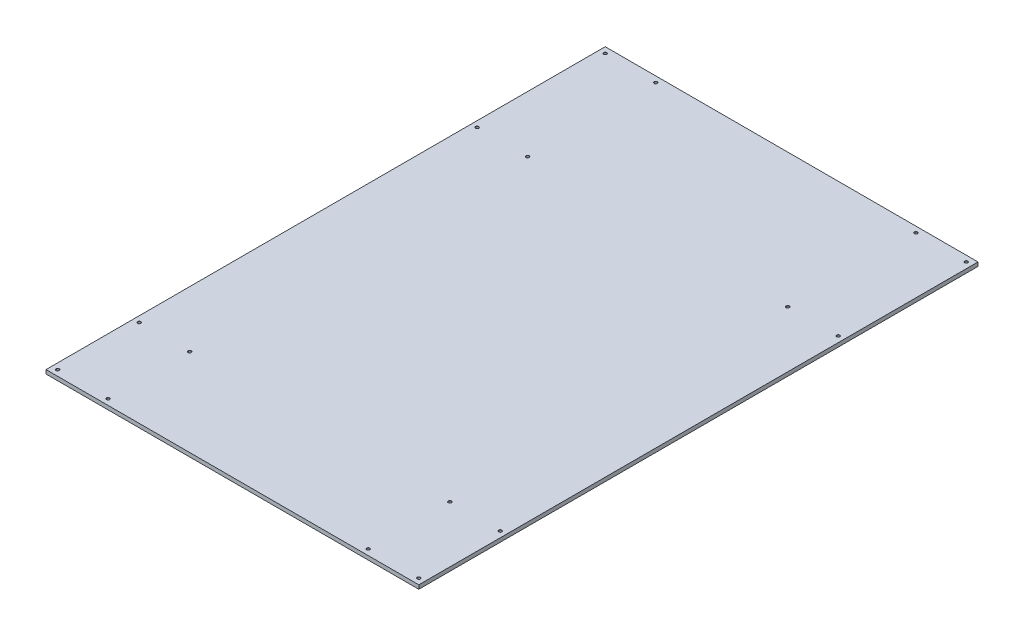
ISO-10303-21;
HEADER;
FILE_DESCRIPTION(('STEP AP214'),'2;1');
FILE_NAME('part.step','',(''),(''),'','','');
FILE_SCHEMA(('AUTOMOTIVE_DESIGN { 1 0 10303 214 1 1 1 1 }'));
ENDSEC;
DATA;
#1=APPLICATION_CONTEXT('core data for automotive mechanical design processes');
#2=APPLICATION_PROTOCOL_DEFINITION('international standard','automotive_design',2000,#1);
#3=PRODUCT_CONTEXT('',#1,'mechanical');
#4=PRODUCT('Part','Part','',(#3));
#5=PRODUCT_RELATED_PRODUCT_CATEGORY('part','',(#4));
#6=PRODUCT_DEFINITION_FORMATION('','',#4);
#7=PRODUCT_DEFINITION_CONTEXT('part definition',#1,'design');
#8=PRODUCT_DEFINITION('design','',#6,#7);
#9=PRODUCT_DEFINITION_SHAPE('','',#8);
#10=(LENGTH_UNIT() NAMED_UNIT(*) SI_UNIT(.MILLI.,.METRE.));
#11=(NAMED_UNIT(*) PLANE_ANGLE_UNIT() SI_UNIT($,.RADIAN.));
#12=(NAMED_UNIT(*) SI_UNIT($,.STERADIAN.) SOLID_ANGLE_UNIT());
#13=UNCERTAINTY_MEASURE_WITH_UNIT(LENGTH_MEASURE(1.E-05),#10,'distance_accuracy_value','');
#14=(GEOMETRIC_REPRESENTATION_CONTEXT(3) GLOBAL_UNCERTAINTY_ASSIGNED_CONTEXT((#13)) GLOBAL_UNIT_ASSIGNED_CONTEXT((#10,
#11,#12)) REPRESENTATION_CONTEXT('',''));
#15=CARTESIAN_POINT('',(0.,0.,0.));
#16=DIRECTION('',(0.,0.,1.));
#17=DIRECTION('',(1.,0.,0.));
#18=AXIS2_PLACEMENT_3D('',#15,#16,#17);
#19=CARTESIAN_POINT('',(609.6,-12.7,914.4));
#20=DIRECTION('',(1.,0.,0.));
#21=DIRECTION('',(0.,0.,-1.));
#22=AXIS2_PLACEMENT_3D('',#19,#20,#21);
#23=PLANE('',#22);
#24=DIRECTION('',(0.,0.,-1.));
#25=VECTOR('',#24,1.);
#26=CARTESIAN_POINT('',(609.6,0.,914.4));
#27=LINE('',#26,#25);
#28=CARTESIAN_POINT('',(609.6,0.,914.4));
#29=VERTEX_POINT('',#28);
#30=CARTESIAN_POINT('',(609.6,0.,-914.4));
#31=VERTEX_POINT('',#30);
#32=EDGE_CURVE('E285',#29,#31,#27,.T.);
#33=ORIENTED_EDGE('',*,*,#32,.F.);
#34=DIRECTION('',(0.,1.,0.));
#35=VECTOR('',#34,1.);
#36=CARTESIAN_POINT('',(609.6,-12.7,914.4));
#37=LINE('',#36,#35);
#38=CARTESIAN_POINT('',(609.6,-12.7,914.4));
#39=VERTEX_POINT('',#38);
#40=EDGE_CURVE('E11',#39,#29,#37,.T.);
#41=ORIENTED_EDGE('',*,*,#40,.F.);
#42=DIRECTION('',(0.,0.,-1.));
#43=VECTOR('',#42,1.);
#44=CARTESIAN_POINT('',(609.6,-12.7,914.4));
#45=LINE('',#44,#43);
#46=CARTESIAN_POINT('',(609.6,-12.7,-914.4));
#47=VERTEX_POINT('',#46);
#48=EDGE_CURVE('E286',#39,#47,#45,.T.);
#49=ORIENTED_EDGE('',*,*,#48,.T.);
#50=DIRECTION('',(0.,1.,0.));
#51=VECTOR('',#50,1.);
#52=CARTESIAN_POINT('',(609.6,-12.7,-914.4));
#53=LINE('',#52,#51);
#54=EDGE_CURVE('E42',#47,#31,#53,.T.);
#55=ORIENTED_EDGE('',*,*,#54,.T.);
#56=EDGE_LOOP('',(#33,#41,#49,#55));
#57=FACE_BOUND('',#56,.T.);
#58=ADVANCED_FACE('F39',(#57),#23,.T.);
#59=CARTESIAN_POINT('',(-609.6,-12.7,914.4));
#60=DIRECTION('',(0.,0.,1.));
#61=DIRECTION('',(1.,0.,0.));
#62=AXIS2_PLACEMENT_3D('',#59,#60,#61);
#63=PLANE('',#62);
#64=DIRECTION('',(1.,0.,0.));
#65=VECTOR('',#64,1.);
#66=CARTESIAN_POINT('',(-609.6,0.,914.4));
#67=LINE('',#66,#65);
#68=CARTESIAN_POINT('',(-609.6,0.,914.4));
#69=VERTEX_POINT('',#68);
#70=EDGE_CURVE('E289',#69,#29,#67,.T.);
#71=ORIENTED_EDGE('',*,*,#70,.F.);
#72=DIRECTION('',(0.,1.,0.));
#73=VECTOR('',#72,1.);
#74=CARTESIAN_POINT('',(-609.6,-12.7,914.4));
#75=LINE('',#74,#73);
#76=CARTESIAN_POINT('',(-609.6,-12.7,914.4));
#77=VERTEX_POINT('',#76);
#78=EDGE_CURVE('E48',#77,#69,#75,.T.);
#79=ORIENTED_EDGE('',*,*,#78,.F.);
#80=DIRECTION('',(1.,0.,0.));
#81=VECTOR('',#80,1.);
#82=CARTESIAN_POINT('',(-609.6,-12.7,914.4));
#83=LINE('',#82,#81);
#84=EDGE_CURVE('E293',#77,#39,#83,.T.);
#85=ORIENTED_EDGE('',*,*,#84,.T.);
#86=ORIENTED_EDGE('',*,*,#40,.T.);
#87=EDGE_LOOP('',(#71,#79,#85,#86));
#88=FACE_BOUND('',#87,.T.);
#89=ADVANCED_FACE('F308',(#88),#63,.T.);
#90=CARTESIAN_POINT('',(-609.6,-12.7,914.4));
#91=DIRECTION('',(-1.,0.,0.));
#92=DIRECTION('',(0.,0.,1.));
#93=AXIS2_PLACEMENT_3D('',#90,#91,#92);
#94=PLANE('',#93);
#95=DIRECTION('',(0.,0.,1.));
#96=VECTOR('',#95,1.);
#97=CARTESIAN_POINT('',(-609.6,0.,914.4));
#98=LINE('',#97,#96);
#99=CARTESIAN_POINT('',(-609.6,0.,-914.4));
#100=VERTEX_POINT('',#99);
#101=EDGE_CURVE('E300',#100,#69,#98,.T.);
#102=ORIENTED_EDGE('',*,*,#101,.F.);
#103=DIRECTION('',(0.,1.,0.));
#104=VECTOR('',#103,1.);
#105=CARTESIAN_POINT('',(-609.6,-12.7,-914.4));
#106=LINE('',#105,#104);
#107=CARTESIAN_POINT('',(-609.6,-12.7,-914.4));
#108=VERTEX_POINT('',#107);
#109=EDGE_CURVE('E304',#108,#100,#106,.T.);
#110=ORIENTED_EDGE('',*,*,#109,.F.);
#111=DIRECTION('',(0.,0.,1.));
#112=VECTOR('',#111,1.);
#113=CARTESIAN_POINT('',(-609.6,-12.7,914.4));
#114=LINE('',#113,#112);
#115=EDGE_CURVE('E291',#108,#77,#114,.T.);
#116=ORIENTED_EDGE('',*,*,#115,.T.);
#117=ORIENTED_EDGE('',*,*,#78,.T.);
#118=EDGE_LOOP('',(#102,#110,#116,#117));
#119=FACE_BOUND('',#118,.T.);
#120=ADVANCED_FACE('F311',(#119),#94,.T.);
#121=CARTESIAN_POINT('',(-609.6,-12.7,-914.4));
#122=DIRECTION('',(0.,0.,-1.));
#123=DIRECTION('',(-1.,0.,0.));
#124=AXIS2_PLACEMENT_3D('',#121,#122,#123);
#125=PLANE('',#124);
#126=DIRECTION('',(-1.,0.,0.));
#127=VECTOR('',#126,1.);
#128=CARTESIAN_POINT('',(-609.6,0.,-914.4));
#129=LINE('',#128,#127);
#130=EDGE_CURVE('E297',#31,#100,#129,.T.);
#131=ORIENTED_EDGE('',*,*,#130,.F.);
#132=ORIENTED_EDGE('',*,*,#54,.F.);
#133=DIRECTION('',(-1.,0.,0.));
#134=VECTOR('',#133,1.);
#135=CARTESIAN_POINT('',(-609.6,-12.7,-914.4));
#136=LINE('',#135,#134);
#137=EDGE_CURVE('E288',#47,#108,#136,.T.);
#138=ORIENTED_EDGE('',*,*,#137,.T.);
#139=ORIENTED_EDGE('',*,*,#109,.T.);
#140=EDGE_LOOP('',(#131,#132,#138,#139));
#141=FACE_BOUND('',#140,.T.);
#142=ADVANCED_FACE('F305',(#141),#125,.T.);
#143=CARTESIAN_POINT('',(0.,-12.7,0.));
#144=DIRECTION('',(0.,-1.,0.));
#145=DIRECTION('',(0.,0.,-1.));
#146=AXIS2_PLACEMENT_3D('',#143,#144,#145);
#147=PLANE('',#146);
#148=ORIENTED_EDGE('',*,*,#48,.F.);
#149=ORIENTED_EDGE('',*,*,#84,.F.);
#150=ORIENTED_EDGE('',*,*,#115,.F.);
#151=ORIENTED_EDGE('',*,*,#137,.F.);
#152=EDGE_LOOP('',(#148,#149,#150,#151));
#153=FACE_BOUND('',#152,.T.);
#154=ADVANCED_FACE('F313',(#153),#147,.T.);
#155=CARTESIAN_POINT('',(0.,0.,0.));
#156=DIRECTION('',(0.,-1.,0.));
#157=DIRECTION('',(0.,0.,-1.));
#158=AXIS2_PLACEMENT_3D('',#155,#156,#157);
#159=PLANE('',#158);
#160=CARTESIAN_POINT('',(590.55,0.,-895.35));
#161=DIRECTION('',(0.,1.,0.));
#162=DIRECTION('',(0.,0.,1.));
#163=AXIS2_PLACEMENT_3D('',#160,#161,#162);
#164=CIRCLE('',#163,5.19912600000005);
#165=CARTESIAN_POINT('',(590.55,0.,-890.150874));
#166=VERTEX_POINT('',#165);
#167=EDGE_CURVE('E150',#166,#166,#164,.T.);
#168=ORIENTED_EDGE('',*,*,#167,.F.);
#169=EDGE_LOOP('',(#168));
#170=FACE_BOUND('',#169,.T.);
#171=CARTESIAN_POINT('',(425.45,0.,-895.35));
#172=DIRECTION('',(0.,1.,0.));
#173=DIRECTION('',(0.,0.,1.));
#174=AXIS2_PLACEMENT_3D('',#171,#172,#173);
#175=CIRCLE('',#174,5.199126);
#176=CARTESIAN_POINT('',(425.45,0.,-890.150874));
#177=VERTEX_POINT('',#176);
#178=EDGE_CURVE('E143',#177,#177,#175,.T.);
#179=ORIENTED_EDGE('',*,*,#178,.F.);
#180=EDGE_LOOP('',(#179));
#181=FACE_BOUND('',#180,.T.);
#182=CARTESIAN_POINT('',(425.45,0.,-476.25));
#183=DIRECTION('',(0.,1.,0.));
#184=DIRECTION('',(0.,0.,1.));
#185=AXIS2_PLACEMENT_3D('',#182,#183,#184);
#186=CIRCLE('',#185,5.199126);
#187=CARTESIAN_POINT('',(425.45,0.,-471.050874));
#188=VERTEX_POINT('',#187);
#189=EDGE_CURVE('E159',#188,#188,#186,.T.);
#190=ORIENTED_EDGE('',*,*,#189,.F.);
#191=EDGE_LOOP('',(#190));
#192=FACE_BOUND('',#191,.T.);
#193=CARTESIAN_POINT('',(590.55,0.,-476.25));
#194=DIRECTION('',(0.,1.,0.));
#195=DIRECTION('',(0.,0.,1.));
#196=AXIS2_PLACEMENT_3D('',#193,#194,#195);
#197=CIRCLE('',#196,5.19912600000005);
#198=CARTESIAN_POINT('',(590.55,0.,-471.050874));
#199=VERTEX_POINT('',#198);
#200=EDGE_CURVE('E168',#199,#199,#197,.T.);
#201=ORIENTED_EDGE('',*,*,#200,.F.);
#202=EDGE_LOOP('',(#201));
#203=FACE_BOUND('',#202,.T.);
#204=CARTESIAN_POINT('',(590.55,0.,628.65));
#205=DIRECTION('',(0.,1.,0.));
#206=DIRECTION('',(0.,0.,1.));
#207=AXIS2_PLACEMENT_3D('',#204,#205,#206);
#208=CIRCLE('',#207,5.19912600000005);
#209=CARTESIAN_POINT('',(590.55,0.,633.849126));
#210=VERTEX_POINT('',#209);
#211=EDGE_CURVE('E177',#210,#210,#208,.T.);
#212=ORIENTED_EDGE('',*,*,#211,.F.);
#213=EDGE_LOOP('',(#212));
#214=FACE_BOUND('',#213,.T.);
#215=CARTESIAN_POINT('',(425.45,0.,628.65));
#216=DIRECTION('',(0.,1.,0.));
#217=DIRECTION('',(0.,0.,1.));
#218=AXIS2_PLACEMENT_3D('',#215,#216,#217);
#219=CIRCLE('',#218,5.199126);
#220=CARTESIAN_POINT('',(425.45,0.,633.849126));
#221=VERTEX_POINT('',#220);
#222=EDGE_CURVE('E186',#221,#221,#219,.T.);
#223=ORIENTED_EDGE('',*,*,#222,.F.);
#224=EDGE_LOOP('',(#223));
#225=FACE_BOUND('',#224,.T.);
#226=CARTESIAN_POINT('',(425.45,0.,895.35));
#227=DIRECTION('',(0.,1.,0.));
#228=DIRECTION('',(0.,0.,1.));
#229=AXIS2_PLACEMENT_3D('',#226,#227,#228);
#230=CIRCLE('',#229,5.199126);
#231=CARTESIAN_POINT('',(425.45,0.,900.549126));
#232=VERTEX_POINT('',#231);
#233=EDGE_CURVE('E195',#232,#232,#230,.T.);
#234=ORIENTED_EDGE('',*,*,#233,.F.);
#235=EDGE_LOOP('',(#234));
#236=FACE_BOUND('',#235,.T.);
#237=CARTESIAN_POINT('',(590.55,0.,895.35));
#238=DIRECTION('',(0.,1.,0.));
#239=DIRECTION('',(0.,0.,1.));
#240=AXIS2_PLACEMENT_3D('',#237,#238,#239);
#241=CIRCLE('',#240,5.19912600000005);
#242=CARTESIAN_POINT('',(590.55,0.,900.549126));
#243=VERTEX_POINT('',#242);
#244=EDGE_CURVE('E204',#243,#243,#241,.T.);
#245=ORIENTED_EDGE('',*,*,#244,.F.);
#246=EDGE_LOOP('',(#245));
#247=FACE_BOUND('',#246,.T.);
#248=CARTESIAN_POINT('',(-590.55,0.,-895.35));
#249=DIRECTION('',(0.,1.,0.));
#250=DIRECTION('',(0.,0.,1.));
#251=AXIS2_PLACEMENT_3D('',#248,#249,#250);
#252=CIRCLE('',#251,5.19912600000005);
#253=CARTESIAN_POINT('',(-590.55,0.,-890.150874));
#254=VERTEX_POINT('',#253);
#255=EDGE_CURVE('E213',#254,#254,#252,.T.);
#256=ORIENTED_EDGE('',*,*,#255,.F.);
#257=EDGE_LOOP('',(#256));
#258=FACE_BOUND('',#257,.T.);
#259=CARTESIAN_POINT('',(-425.45,0.,-895.35));
#260=DIRECTION('',(0.,1.,0.));
#261=DIRECTION('',(0.,0.,1.));
#262=AXIS2_PLACEMENT_3D('',#259,#260,#261);
#263=CIRCLE('',#262,5.199126);
#264=CARTESIAN_POINT('',(-425.45,0.,-890.150874));
#265=VERTEX_POINT('',#264);
#266=EDGE_CURVE('E222',#265,#265,#263,.T.);
#267=ORIENTED_EDGE('',*,*,#266,.F.);
#268=EDGE_LOOP('',(#267));
#269=FACE_BOUND('',#268,.T.);
#270=CARTESIAN_POINT('',(-425.45,0.,-476.25));
#271=DIRECTION('',(0.,1.,0.));
#272=DIRECTION('',(0.,0.,1.));
#273=AXIS2_PLACEMENT_3D('',#270,#271,#272);
#274=CIRCLE('',#273,5.199126);
#275=CARTESIAN_POINT('',(-425.45,0.,-471.050874));
#276=VERTEX_POINT('',#275);
#277=EDGE_CURVE('E231',#276,#276,#274,.T.);
#278=ORIENTED_EDGE('',*,*,#277,.F.);
#279=EDGE_LOOP('',(#278));
#280=FACE_BOUND('',#279,.T.);
#281=CARTESIAN_POINT('',(-590.55,0.,-476.25));
#282=DIRECTION('',(0.,1.,0.));
#283=DIRECTION('',(0.,0.,1.));
#284=AXIS2_PLACEMENT_3D('',#281,#282,#283);
#285=CIRCLE('',#284,5.19912600000005);
#286=CARTESIAN_POINT('',(-590.55,0.,-471.050874));
#287=VERTEX_POINT('',#286);
#288=EDGE_CURVE('E240',#287,#287,#285,.T.);
#289=ORIENTED_EDGE('',*,*,#288,.F.);
#290=EDGE_LOOP('',(#289));
#291=FACE_BOUND('',#290,.T.);
#292=CARTESIAN_POINT('',(-590.55,0.,628.65));
#293=DIRECTION('',(0.,1.,0.));
#294=DIRECTION('',(0.,0.,1.));
#295=AXIS2_PLACEMENT_3D('',#292,#293,#294);
#296=CIRCLE('',#295,5.19912600000005);
#297=CARTESIAN_POINT('',(-590.55,0.,633.849126));
#298=VERTEX_POINT('',#297);
#299=EDGE_CURVE('E249',#298,#298,#296,.T.);
#300=ORIENTED_EDGE('',*,*,#299,.F.);
#301=EDGE_LOOP('',(#300));
#302=FACE_BOUND('',#301,.T.);
#303=CARTESIAN_POINT('',(-425.45,0.,628.65));
#304=DIRECTION('',(0.,1.,0.));
#305=DIRECTION('',(0.,0.,1.));
#306=AXIS2_PLACEMENT_3D('',#303,#304,#305);
#307=CIRCLE('',#306,5.199126);
#308=CARTESIAN_POINT('',(-425.45,0.,633.849126));
#309=VERTEX_POINT('',#308);
#310=EDGE_CURVE('E258',#309,#309,#307,.T.);
#311=ORIENTED_EDGE('',*,*,#310,.F.);
#312=EDGE_LOOP('',(#311));
#313=FACE_BOUND('',#312,.T.);
#314=CARTESIAN_POINT('',(-425.45,0.,895.35));
#315=DIRECTION('',(0.,1.,0.));
#316=DIRECTION('',(0.,0.,1.));
#317=AXIS2_PLACEMENT_3D('',#314,#315,#316);
#318=CIRCLE('',#317,5.199126);
#319=CARTESIAN_POINT('',(-425.45,0.,900.549126));
#320=VERTEX_POINT('',#319);
#321=EDGE_CURVE('E267',#320,#320,#318,.T.);
#322=ORIENTED_EDGE('',*,*,#321,.F.);
#323=EDGE_LOOP('',(#322));
#324=FACE_BOUND('',#323,.T.);
#325=CARTESIAN_POINT('',(-590.55,0.,895.35));
#326=DIRECTION('',(0.,1.,0.));
#327=DIRECTION('',(0.,0.,1.));
#328=AXIS2_PLACEMENT_3D('',#325,#326,#327);
#329=CIRCLE('',#328,5.19912600000005);
#330=CARTESIAN_POINT('',(-590.55,0.,900.549126));
#331=VERTEX_POINT('',#330);
#332=EDGE_CURVE('E276',#331,#331,#329,.T.);
#333=ORIENTED_EDGE('',*,*,#332,.F.);
#334=EDGE_LOOP('',(#333));
#335=FACE_BOUND('',#334,.T.);
#336=ORIENTED_EDGE('',*,*,#32,.T.);
#337=ORIENTED_EDGE('',*,*,#130,.T.);
#338=ORIENTED_EDGE('',*,*,#101,.T.);
#339=ORIENTED_EDGE('',*,*,#70,.T.);
#340=EDGE_LOOP('',(#336,#337,#338,#339));
#341=FACE_BOUND('',#340,.T.);
#342=ADVANCED_FACE('F307',(#170,#181,#192,#203,#214,#225,#236,#247,#258,#269,#280,#291,#302,
#313,#324,#335,#341),#159,.F.);
#343=CARTESIAN_POINT('',(-590.55,-7.17947142632021,895.35));
#344=DIRECTION('',(0.,1.,0.));
#345=DIRECTION('',(0.,0.,1.));
#346=AXIS2_PLACEMENT_3D('',#343,#344,#345);
#347=CONICAL_SURFACE('',#346,4.564126,1.02974425867665);
#348=CARTESIAN_POINT('',(-590.55,-9.921875,895.35));
#349=VERTEX_POINT('',#348);
#350=VERTEX_LOOP('',#349);
#351=FACE_BOUND('',#350,.T.);
#352=CARTESIAN_POINT('',(-590.55,-7.17947142632021,895.35));
#353=DIRECTION('',(0.,1.,0.));
#354=DIRECTION('',(0.,0.,1.));
#355=AXIS2_PLACEMENT_3D('',#352,#353,#354);
#356=CIRCLE('',#355,4.564126);
#357=CARTESIAN_POINT('',(-590.55,-7.17947142632021,899.914126));
#358=VERTEX_POINT('',#357);
#359=EDGE_CURVE('E282',#358,#358,#356,.T.);
#360=ORIENTED_EDGE('',*,*,#359,.T.);
#361=EDGE_LOOP('',(#360));
#362=FACE_BOUND('',#361,.T.);
#363=ADVANCED_FACE('F321',(#351,#362),#347,.F.);
#364=CARTESIAN_POINT('',(-590.55,0.,895.35));
#365=DIRECTION('',(0.,1.,0.));
#366=DIRECTION('',(0.,0.,1.));
#367=AXIS2_PLACEMENT_3D('',#364,#365,#366);
#368=CYLINDRICAL_SURFACE('',#367,4.564126);
#369=ORIENTED_EDGE('',*,*,#359,.F.);
#370=EDGE_LOOP('',(#369));
#371=FACE_BOUND('',#370,.T.);
#372=CARTESIAN_POINT('',(-590.55,-0.634999999999998,895.35));
#373=DIRECTION('',(0.,1.,0.));
#374=DIRECTION('',(0.,0.,1.));
#375=AXIS2_PLACEMENT_3D('',#372,#373,#374);
#376=CIRCLE('',#375,4.564126);
#377=CARTESIAN_POINT('',(-590.55,-0.634999999999998,899.914126));
#378=VERTEX_POINT('',#377);
#379=EDGE_CURVE('E279',#378,#378,#376,.T.);
#380=ORIENTED_EDGE('',*,*,#379,.T.);
#381=EDGE_LOOP('',(#380));
#382=FACE_BOUND('',#381,.T.);
#383=ADVANCED_FACE('F362',(#371,#382),#368,.F.);
#384=CARTESIAN_POINT('',(-590.55,0.,895.35));
#385=DIRECTION('',(0.,1.,0.));
#386=DIRECTION('',(0.,0.,1.));
#387=AXIS2_PLACEMENT_3D('',#384,#385,#386);
#388=CONICAL_SURFACE('',#387,5.19912600000005,0.785398163397491);
#389=ORIENTED_EDGE('',*,*,#379,.F.);
#390=EDGE_LOOP('',(#389));
#391=FACE_BOUND('',#390,.T.);
#392=ORIENTED_EDGE('',*,*,#332,.T.);
#393=EDGE_LOOP('',(#392));
#394=FACE_BOUND('',#393,.T.);
#395=ADVANCED_FACE('F371',(#391,#394),#388,.F.);
#396=CARTESIAN_POINT('',(-425.45,-7.17947142632021,895.35));
#397=DIRECTION('',(0.,1.,0.));
#398=DIRECTION('',(0.,0.,1.));
#399=AXIS2_PLACEMENT_3D('',#396,#397,#398);
#400=CONICAL_SURFACE('',#399,4.564126,1.02974425867665);
#401=CARTESIAN_POINT('',(-425.45,-9.921875,895.35));
#402=VERTEX_POINT('',#401);
#403=VERTEX_LOOP('',#402);
#404=FACE_BOUND('',#403,.T.);
#405=CARTESIAN_POINT('',(-425.45,-7.17947142632021,895.35));
#406=DIRECTION('',(0.,1.,0.));
#407=DIRECTION('',(0.,0.,1.));
#408=AXIS2_PLACEMENT_3D('',#405,#406,#407);
#409=CIRCLE('',#408,4.564126);
#410=CARTESIAN_POINT('',(-425.45,-7.17947142632021,899.914126));
#411=VERTEX_POINT('',#410);
#412=EDGE_CURVE('E273',#411,#411,#409,.T.);
#413=ORIENTED_EDGE('',*,*,#412,.T.);
#414=EDGE_LOOP('',(#413));
#415=FACE_BOUND('',#414,.T.);
#416=ADVANCED_FACE('F381',(#404,#415),#400,.F.);
#417=CARTESIAN_POINT('',(-425.45,0.,895.35));
#418=DIRECTION('',(0.,1.,0.));
#419=DIRECTION('',(0.,0.,1.));
#420=AXIS2_PLACEMENT_3D('',#417,#418,#419);
#421=CYLINDRICAL_SURFACE('',#420,4.564126);
#422=ORIENTED_EDGE('',*,*,#412,.F.);
#423=EDGE_LOOP('',(#422));
#424=FACE_BOUND('',#423,.T.);
#425=CARTESIAN_POINT('',(-425.45,-0.634999999999998,895.35));
#426=DIRECTION('',(0.,1.,0.));
#427=DIRECTION('',(0.,0.,1.));
#428=AXIS2_PLACEMENT_3D('',#425,#426,#427);
#429=CIRCLE('',#428,4.564126);
#430=CARTESIAN_POINT('',(-425.45,-0.634999999999998,899.914126));
#431=VERTEX_POINT('',#430);
#432=EDGE_CURVE('E270',#431,#431,#429,.T.);
#433=ORIENTED_EDGE('',*,*,#432,.T.);
#434=EDGE_LOOP('',(#433));
#435=FACE_BOUND('',#434,.T.);
#436=ADVANCED_FACE('F391',(#424,#435),#421,.F.);
#437=CARTESIAN_POINT('',(-425.45,0.,895.35));
#438=DIRECTION('',(0.,1.,0.));
#439=DIRECTION('',(0.,0.,1.));
#440=AXIS2_PLACEMENT_3D('',#437,#438,#439);
#441=CONICAL_SURFACE('',#440,5.199126,0.785398163397447);
#442=ORIENTED_EDGE('',*,*,#432,.F.);
#443=EDGE_LOOP('',(#442));
#444=FACE_BOUND('',#443,.T.);
#445=ORIENTED_EDGE('',*,*,#321,.T.);
#446=EDGE_LOOP('',(#445));
#447=FACE_BOUND('',#446,.T.);
#448=ADVANCED_FACE('F401',(#444,#447),#441,.F.);
#449=CARTESIAN_POINT('',(-425.45,-7.17947142632021,628.65));
#450=DIRECTION('',(0.,1.,0.));
#451=DIRECTION('',(0.,0.,1.));
#452=AXIS2_PLACEMENT_3D('',#449,#450,#451);
#453=CONICAL_SURFACE('',#452,4.564126,1.02974425867665);
#454=CARTESIAN_POINT('',(-425.45,-9.921875,628.65));
#455=VERTEX_POINT('',#454);
#456=VERTEX_LOOP('',#455);
#457=FACE_BOUND('',#456,.T.);
#458=CARTESIAN_POINT('',(-425.45,-7.17947142632021,628.65));
#459=DIRECTION('',(0.,1.,0.));
#460=DIRECTION('',(0.,0.,1.));
#461=AXIS2_PLACEMENT_3D('',#458,#459,#460);
#462=CIRCLE('',#461,4.564126);
#463=CARTESIAN_POINT('',(-425.45,-7.17947142632021,633.214126));
#464=VERTEX_POINT('',#463);
#465=EDGE_CURVE('E264',#464,#464,#462,.T.);
#466=ORIENTED_EDGE('',*,*,#465,.T.);
#467=EDGE_LOOP('',(#466));
#468=FACE_BOUND('',#467,.T.);
#469=ADVANCED_FACE('F411',(#457,#468),#453,.F.);
#470=CARTESIAN_POINT('',(-425.45,0.,628.65));
#471=DIRECTION('',(0.,1.,0.));
#472=DIRECTION('',(0.,0.,1.));
#473=AXIS2_PLACEMENT_3D('',#470,#471,#472);
#474=CYLINDRICAL_SURFACE('',#473,4.564126);
#475=ORIENTED_EDGE('',*,*,#465,.F.);
#476=EDGE_LOOP('',(#475));
#477=FACE_BOUND('',#476,.T.);
#478=CARTESIAN_POINT('',(-425.45,-0.634999999999998,628.65));
#479=DIRECTION('',(0.,1.,0.));
#480=DIRECTION('',(0.,0.,1.));
#481=AXIS2_PLACEMENT_3D('',#478,#479,#480);
#482=CIRCLE('',#481,4.564126);
#483=CARTESIAN_POINT('',(-425.45,-0.634999999999998,633.214126));
#484=VERTEX_POINT('',#483);
#485=EDGE_CURVE('E261',#484,#484,#482,.T.);
#486=ORIENTED_EDGE('',*,*,#485,.T.);
#487=EDGE_LOOP('',(#486));
#488=FACE_BOUND('',#487,.T.);
#489=ADVANCED_FACE('F421',(#477,#488),#474,.F.);
#490=CARTESIAN_POINT('',(-425.45,0.,628.65));
#491=DIRECTION('',(0.,1.,0.));
#492=DIRECTION('',(0.,0.,1.));
#493=AXIS2_PLACEMENT_3D('',#490,#491,#492);
#494=CONICAL_SURFACE('',#493,5.199126,0.785398163397447);
#495=ORIENTED_EDGE('',*,*,#485,.F.);
#496=EDGE_LOOP('',(#495));
#497=FACE_BOUND('',#496,.T.);
#498=ORIENTED_EDGE('',*,*,#310,.T.);
#499=EDGE_LOOP('',(#498));
#500=FACE_BOUND('',#499,.T.);
#501=ADVANCED_FACE('F431',(#497,#500),#494,.F.);
#502=CARTESIAN_POINT('',(-590.55,-7.17947142632021,628.65));
#503=DIRECTION('',(0.,1.,0.));
#504=DIRECTION('',(0.,0.,1.));
#505=AXIS2_PLACEMENT_3D('',#502,#503,#504);
#506=CONICAL_SURFACE('',#505,4.564126,1.02974425867665);
#507=CARTESIAN_POINT('',(-590.55,-9.921875,628.65));
#508=VERTEX_POINT('',#507);
#509=VERTEX_LOOP('',#508);
#510=FACE_BOUND('',#509,.T.);
#511=CARTESIAN_POINT('',(-590.55,-7.17947142632021,628.65));
#512=DIRECTION('',(0.,1.,0.));
#513=DIRECTION('',(0.,0.,1.));
#514=AXIS2_PLACEMENT_3D('',#511,#512,#513);
#515=CIRCLE('',#514,4.564126);
#516=CARTESIAN_POINT('',(-590.55,-7.17947142632021,633.214126));
#517=VERTEX_POINT('',#516);
#518=EDGE_CURVE('E255',#517,#517,#515,.T.);
#519=ORIENTED_EDGE('',*,*,#518,.T.);
#520=EDGE_LOOP('',(#519));
#521=FACE_BOUND('',#520,.T.);
#522=ADVANCED_FACE('F441',(#510,#521),#506,.F.);
#523=CARTESIAN_POINT('',(-590.55,0.,628.65));
#524=DIRECTION('',(0.,1.,0.));
#525=DIRECTION('',(0.,0.,1.));
#526=AXIS2_PLACEMENT_3D('',#523,#524,#525);
#527=CYLINDRICAL_SURFACE('',#526,4.564126);
#528=ORIENTED_EDGE('',*,*,#518,.F.);
#529=EDGE_LOOP('',(#528));
#530=FACE_BOUND('',#529,.T.);
#531=CARTESIAN_POINT('',(-590.55,-0.634999999999998,628.65));
#532=DIRECTION('',(0.,1.,0.));
#533=DIRECTION('',(0.,0.,1.));
#534=AXIS2_PLACEMENT_3D('',#531,#532,#533);
#535=CIRCLE('',#534,4.564126);
#536=CARTESIAN_POINT('',(-590.55,-0.634999999999998,633.214126));
#537=VERTEX_POINT('',#536);
#538=EDGE_CURVE('E252',#537,#537,#535,.T.);
#539=ORIENTED_EDGE('',*,*,#538,.T.);
#540=EDGE_LOOP('',(#539));
#541=FACE_BOUND('',#540,.T.);
#542=ADVANCED_FACE('F451',(#530,#541),#527,.F.);
#543=CARTESIAN_POINT('',(-590.55,0.,628.65));
#544=DIRECTION('',(0.,1.,0.));
#545=DIRECTION('',(0.,0.,1.));
#546=AXIS2_PLACEMENT_3D('',#543,#544,#545);
#547=CONICAL_SURFACE('',#546,5.19912600000005,0.785398163397491);
#548=ORIENTED_EDGE('',*,*,#538,.F.);
#549=EDGE_LOOP('',(#548));
#550=FACE_BOUND('',#549,.T.);
#551=ORIENTED_EDGE('',*,*,#299,.T.);
#552=EDGE_LOOP('',(#551));
#553=FACE_BOUND('',#552,.T.);
#554=ADVANCED_FACE('F461',(#550,#553),#547,.F.);
#555=CARTESIAN_POINT('',(-590.55,-7.17947142632021,-476.25));
#556=DIRECTION('',(0.,1.,0.));
#557=DIRECTION('',(0.,0.,1.));
#558=AXIS2_PLACEMENT_3D('',#555,#556,#557);
#559=CONICAL_SURFACE('',#558,4.564126,1.02974425867665);
#560=CARTESIAN_POINT('',(-590.55,-9.921875,-476.25));
#561=VERTEX_POINT('',#560);
#562=VERTEX_LOOP('',#561);
#563=FACE_BOUND('',#562,.T.);
#564=CARTESIAN_POINT('',(-590.55,-7.17947142632021,-476.25));
#565=DIRECTION('',(0.,1.,0.));
#566=DIRECTION('',(0.,0.,1.));
#567=AXIS2_PLACEMENT_3D('',#564,#565,#566);
#568=CIRCLE('',#567,4.564126);
#569=CARTESIAN_POINT('',(-590.55,-7.17947142632021,-471.685874));
#570=VERTEX_POINT('',#569);
#571=EDGE_CURVE('E246',#570,#570,#568,.T.);
#572=ORIENTED_EDGE('',*,*,#571,.T.);
#573=EDGE_LOOP('',(#572));
#574=FACE_BOUND('',#573,.T.);
#575=ADVANCED_FACE('F471',(#563,#574),#559,.F.);
#576=CARTESIAN_POINT('',(-590.55,0.,-476.25));
#577=DIRECTION('',(0.,1.,0.));
#578=DIRECTION('',(0.,0.,1.));
#579=AXIS2_PLACEMENT_3D('',#576,#577,#578);
#580=CYLINDRICAL_SURFACE('',#579,4.564126);
#581=ORIENTED_EDGE('',*,*,#571,.F.);
#582=EDGE_LOOP('',(#581));
#583=FACE_BOUND('',#582,.T.);
#584=CARTESIAN_POINT('',(-590.55,-0.634999999999998,-476.25));
#585=DIRECTION('',(0.,1.,0.));
#586=DIRECTION('',(0.,0.,1.));
#587=AXIS2_PLACEMENT_3D('',#584,#585,#586);
#588=CIRCLE('',#587,4.564126);
#589=CARTESIAN_POINT('',(-590.55,-0.634999999999998,-471.685874));
#590=VERTEX_POINT('',#589);
#591=EDGE_CURVE('E243',#590,#590,#588,.T.);
#592=ORIENTED_EDGE('',*,*,#591,.T.);
#593=EDGE_LOOP('',(#592));
#594=FACE_BOUND('',#593,.T.);
#595=ADVANCED_FACE('F481',(#583,#594),#580,.F.);
#596=CARTESIAN_POINT('',(-590.55,0.,-476.25));
#597=DIRECTION('',(0.,1.,0.));
#598=DIRECTION('',(0.,0.,1.));
#599=AXIS2_PLACEMENT_3D('',#596,#597,#598);
#600=CONICAL_SURFACE('',#599,5.19912600000005,0.785398163397491);
#601=ORIENTED_EDGE('',*,*,#591,.F.);
#602=EDGE_LOOP('',(#601));
#603=FACE_BOUND('',#602,.T.);
#604=ORIENTED_EDGE('',*,*,#288,.T.);
#605=EDGE_LOOP('',(#604));
#606=FACE_BOUND('',#605,.T.);
#607=ADVANCED_FACE('F491',(#603,#606),#600,.F.);
#608=CARTESIAN_POINT('',(-425.45,-7.17947142632021,-476.25));
#609=DIRECTION('',(0.,1.,0.));
#610=DIRECTION('',(0.,0.,1.));
#611=AXIS2_PLACEMENT_3D('',#608,#609,#610);
#612=CONICAL_SURFACE('',#611,4.564126,1.02974425867665);
#613=CARTESIAN_POINT('',(-425.45,-9.921875,-476.25));
#614=VERTEX_POINT('',#613);
#615=VERTEX_LOOP('',#614);
#616=FACE_BOUND('',#615,.T.);
#617=CARTESIAN_POINT('',(-425.45,-7.17947142632021,-476.25));
#618=DIRECTION('',(0.,1.,0.));
#619=DIRECTION('',(0.,0.,1.));
#620=AXIS2_PLACEMENT_3D('',#617,#618,#619);
#621=CIRCLE('',#620,4.564126);
#622=CARTESIAN_POINT('',(-425.45,-7.17947142632021,-471.685874));
#623=VERTEX_POINT('',#622);
#624=EDGE_CURVE('E237',#623,#623,#621,.T.);
#625=ORIENTED_EDGE('',*,*,#624,.T.);
#626=EDGE_LOOP('',(#625));
#627=FACE_BOUND('',#626,.T.);
#628=ADVANCED_FACE('F501',(#616,#627),#612,.F.);
#629=CARTESIAN_POINT('',(-425.45,0.,-476.25));
#630=DIRECTION('',(0.,1.,0.));
#631=DIRECTION('',(0.,0.,1.));
#632=AXIS2_PLACEMENT_3D('',#629,#630,#631);
#633=CYLINDRICAL_SURFACE('',#632,4.564126);
#634=ORIENTED_EDGE('',*,*,#624,.F.);
#635=EDGE_LOOP('',(#634));
#636=FACE_BOUND('',#635,.T.);
#637=CARTESIAN_POINT('',(-425.45,-0.634999999999998,-476.25));
#638=DIRECTION('',(0.,1.,0.));
#639=DIRECTION('',(0.,0.,1.));
#640=AXIS2_PLACEMENT_3D('',#637,#638,#639);
#641=CIRCLE('',#640,4.564126);
#642=CARTESIAN_POINT('',(-425.45,-0.634999999999998,-471.685874));
#643=VERTEX_POINT('',#642);
#644=EDGE_CURVE('E234',#643,#643,#641,.T.);
#645=ORIENTED_EDGE('',*,*,#644,.T.);
#646=EDGE_LOOP('',(#645));
#647=FACE_BOUND('',#646,.T.);
#648=ADVANCED_FACE('F511',(#636,#647),#633,.F.);
#649=CARTESIAN_POINT('',(-425.45,0.,-476.25));
#650=DIRECTION('',(0.,1.,0.));
#651=DIRECTION('',(0.,0.,1.));
#652=AXIS2_PLACEMENT_3D('',#649,#650,#651);
#653=CONICAL_SURFACE('',#652,5.199126,0.785398163397447);
#654=ORIENTED_EDGE('',*,*,#644,.F.);
#655=EDGE_LOOP('',(#654));
#656=FACE_BOUND('',#655,.T.);
#657=ORIENTED_EDGE('',*,*,#277,.T.);
#658=EDGE_LOOP('',(#657));
#659=FACE_BOUND('',#658,.T.);
#660=ADVANCED_FACE('F521',(#656,#659),#653,.F.);
#661=CARTESIAN_POINT('',(-425.45,-7.17947142632021,-895.35));
#662=DIRECTION('',(0.,1.,0.));
#663=DIRECTION('',(0.,0.,1.));
#664=AXIS2_PLACEMENT_3D('',#661,#662,#663);
#665=CONICAL_SURFACE('',#664,4.564126,1.02974425867665);
#666=CARTESIAN_POINT('',(-425.45,-9.921875,-895.35));
#667=VERTEX_POINT('',#666);
#668=VERTEX_LOOP('',#667);
#669=FACE_BOUND('',#668,.T.);
#670=CARTESIAN_POINT('',(-425.45,-7.17947142632021,-895.35));
#671=DIRECTION('',(0.,1.,0.));
#672=DIRECTION('',(0.,0.,1.));
#673=AXIS2_PLACEMENT_3D('',#670,#671,#672);
#674=CIRCLE('',#673,4.564126);
#675=CARTESIAN_POINT('',(-425.45,-7.17947142632021,-890.785874));
#676=VERTEX_POINT('',#675);
#677=EDGE_CURVE('E228',#676,#676,#674,.T.);
#678=ORIENTED_EDGE('',*,*,#677,.T.);
#679=EDGE_LOOP('',(#678));
#680=FACE_BOUND('',#679,.T.);
#681=ADVANCED_FACE('F531',(#669,#680),#665,.F.);
#682=CARTESIAN_POINT('',(-425.45,0.,-895.35));
#683=DIRECTION('',(0.,1.,0.));
#684=DIRECTION('',(0.,0.,1.));
#685=AXIS2_PLACEMENT_3D('',#682,#683,#684);
#686=CYLINDRICAL_SURFACE('',#685,4.564126);
#687=ORIENTED_EDGE('',*,*,#677,.F.);
#688=EDGE_LOOP('',(#687));
#689=FACE_BOUND('',#688,.T.);
#690=CARTESIAN_POINT('',(-425.45,-0.634999999999998,-895.35));
#691=DIRECTION('',(0.,1.,0.));
#692=DIRECTION('',(0.,0.,1.));
#693=AXIS2_PLACEMENT_3D('',#690,#691,#692);
#694=CIRCLE('',#693,4.564126);
#695=CARTESIAN_POINT('',(-425.45,-0.634999999999998,-890.785874));
#696=VERTEX_POINT('',#695);
#697=EDGE_CURVE('E225',#696,#696,#694,.T.);
#698=ORIENTED_EDGE('',*,*,#697,.T.);
#699=EDGE_LOOP('',(#698));
#700=FACE_BOUND('',#699,.T.);
#701=ADVANCED_FACE('F541',(#689,#700),#686,.F.);
#702=CARTESIAN_POINT('',(-425.45,0.,-895.35));
#703=DIRECTION('',(0.,1.,0.));
#704=DIRECTION('',(0.,0.,1.));
#705=AXIS2_PLACEMENT_3D('',#702,#703,#704);
#706=CONICAL_SURFACE('',#705,5.199126,0.785398163397447);
#707=ORIENTED_EDGE('',*,*,#697,.F.);
#708=EDGE_LOOP('',(#707));
#709=FACE_BOUND('',#708,.T.);
#710=ORIENTED_EDGE('',*,*,#266,.T.);
#711=EDGE_LOOP('',(#710));
#712=FACE_BOUND('',#711,.T.);
#713=ADVANCED_FACE('F551',(#709,#712),#706,.F.);
#714=CARTESIAN_POINT('',(-590.55,-7.17947142632021,-895.35));
#715=DIRECTION('',(0.,1.,0.));
#716=DIRECTION('',(0.,0.,1.));
#717=AXIS2_PLACEMENT_3D('',#714,#715,#716);
#718=CONICAL_SURFACE('',#717,4.564126,1.02974425867665);
#719=CARTESIAN_POINT('',(-590.55,-9.921875,-895.35));
#720=VERTEX_POINT('',#719);
#721=VERTEX_LOOP('',#720);
#722=FACE_BOUND('',#721,.T.);
#723=CARTESIAN_POINT('',(-590.55,-7.17947142632021,-895.35));
#724=DIRECTION('',(0.,1.,0.));
#725=DIRECTION('',(0.,0.,1.));
#726=AXIS2_PLACEMENT_3D('',#723,#724,#725);
#727=CIRCLE('',#726,4.564126);
#728=CARTESIAN_POINT('',(-590.55,-7.17947142632021,-890.785874));
#729=VERTEX_POINT('',#728);
#730=EDGE_CURVE('E219',#729,#729,#727,.T.);
#731=ORIENTED_EDGE('',*,*,#730,.T.);
#732=EDGE_LOOP('',(#731));
#733=FACE_BOUND('',#732,.T.);
#734=ADVANCED_FACE('F561',(#722,#733),#718,.F.);
#735=CARTESIAN_POINT('',(-590.55,0.,-895.35));
#736=DIRECTION('',(0.,1.,0.));
#737=DIRECTION('',(0.,0.,1.));
#738=AXIS2_PLACEMENT_3D('',#735,#736,#737);
#739=CYLINDRICAL_SURFACE('',#738,4.564126);
#740=ORIENTED_EDGE('',*,*,#730,.F.);
#741=EDGE_LOOP('',(#740));
#742=FACE_BOUND('',#741,.T.);
#743=CARTESIAN_POINT('',(-590.55,-0.634999999999998,-895.35));
#744=DIRECTION('',(0.,1.,0.));
#745=DIRECTION('',(0.,0.,1.));
#746=AXIS2_PLACEMENT_3D('',#743,#744,#745);
#747=CIRCLE('',#746,4.564126);
#748=CARTESIAN_POINT('',(-590.55,-0.634999999999998,-890.785874));
#749=VERTEX_POINT('',#748);
#750=EDGE_CURVE('E216',#749,#749,#747,.T.);
#751=ORIENTED_EDGE('',*,*,#750,.T.);
#752=EDGE_LOOP('',(#751));
#753=FACE_BOUND('',#752,.T.);
#754=ADVANCED_FACE('F571',(#742,#753),#739,.F.);
#755=CARTESIAN_POINT('',(-590.55,0.,-895.35));
#756=DIRECTION('',(0.,1.,0.));
#757=DIRECTION('',(0.,0.,1.));
#758=AXIS2_PLACEMENT_3D('',#755,#756,#757);
#759=CONICAL_SURFACE('',#758,5.19912600000005,0.785398163397491);
#760=ORIENTED_EDGE('',*,*,#750,.F.);
#761=EDGE_LOOP('',(#760));
#762=FACE_BOUND('',#761,.T.);
#763=ORIENTED_EDGE('',*,*,#255,.T.);
#764=EDGE_LOOP('',(#763));
#765=FACE_BOUND('',#764,.T.);
#766=ADVANCED_FACE('F581',(#762,#765),#759,.F.);
#767=CARTESIAN_POINT('',(590.55,-7.17947142632021,895.35));
#768=DIRECTION('',(0.,1.,0.));
#769=DIRECTION('',(0.,0.,1.));
#770=AXIS2_PLACEMENT_3D('',#767,#768,#769);
#771=CONICAL_SURFACE('',#770,4.564126,1.02974425867665);
#772=CARTESIAN_POINT('',(590.55,-9.921875,895.35));
#773=VERTEX_POINT('',#772);
#774=VERTEX_LOOP('',#773);
#775=FACE_BOUND('',#774,.T.);
#776=CARTESIAN_POINT('',(590.55,-7.17947142632021,895.35));
#777=DIRECTION('',(0.,1.,0.));
#778=DIRECTION('',(0.,0.,1.));
#779=AXIS2_PLACEMENT_3D('',#776,#777,#778);
#780=CIRCLE('',#779,4.564126);
#781=CARTESIAN_POINT('',(590.55,-7.17947142632021,899.914126));
#782=VERTEX_POINT('',#781);
#783=EDGE_CURVE('E210',#782,#782,#780,.T.);
#784=ORIENTED_EDGE('',*,*,#783,.T.);
#785=EDGE_LOOP('',(#784));
#786=FACE_BOUND('',#785,.T.);
#787=ADVANCED_FACE('F590',(#775,#786),#771,.F.);
#788=CARTESIAN_POINT('',(590.55,0.,895.35));
#789=DIRECTION('',(0.,1.,0.));
#790=DIRECTION('',(0.,0.,1.));
#791=AXIS2_PLACEMENT_3D('',#788,#789,#790);
#792=CYLINDRICAL_SURFACE('',#791,4.564126);
#793=ORIENTED_EDGE('',*,*,#783,.F.);
#794=EDGE_LOOP('',(#793));
#795=FACE_BOUND('',#794,.T.);
#796=CARTESIAN_POINT('',(590.55,-0.634999999999998,895.35));
#797=DIRECTION('',(0.,1.,0.));
#798=DIRECTION('',(0.,0.,1.));
#799=AXIS2_PLACEMENT_3D('',#796,#797,#798);
#800=CIRCLE('',#799,4.564126);
#801=CARTESIAN_POINT('',(590.55,-0.634999999999998,899.914126));
#802=VERTEX_POINT('',#801);
#803=EDGE_CURVE('E207',#802,#802,#800,.T.);
#804=ORIENTED_EDGE('',*,*,#803,.T.);
#805=EDGE_LOOP('',(#804));
#806=FACE_BOUND('',#805,.T.);
#807=ADVANCED_FACE('F599',(#795,#806),#792,.F.);
#808=CARTESIAN_POINT('',(590.55,0.,895.35));
#809=DIRECTION('',(0.,1.,0.));
#810=DIRECTION('',(0.,0.,1.));
#811=AXIS2_PLACEMENT_3D('',#808,#809,#810);
#812=CONICAL_SURFACE('',#811,5.19912600000005,0.785398163397491);
#813=ORIENTED_EDGE('',*,*,#803,.F.);
#814=EDGE_LOOP('',(#813));
#815=FACE_BOUND('',#814,.T.);
#816=ORIENTED_EDGE('',*,*,#244,.T.);
#817=EDGE_LOOP('',(#816));
#818=FACE_BOUND('',#817,.T.);
#819=ADVANCED_FACE('F609',(#815,#818),#812,.F.);
#820=CARTESIAN_POINT('',(425.45,-7.17947142632021,895.35));
#821=DIRECTION('',(0.,1.,0.));
#822=DIRECTION('',(0.,0.,1.));
#823=AXIS2_PLACEMENT_3D('',#820,#821,#822);
#824=CONICAL_SURFACE('',#823,4.564126,1.02974425867665);
#825=CARTESIAN_POINT('',(425.45,-9.921875,895.35));
#826=VERTEX_POINT('',#825);
#827=VERTEX_LOOP('',#826);
#828=FACE_BOUND('',#827,.T.);
#829=CARTESIAN_POINT('',(425.45,-7.17947142632021,895.35));
#830=DIRECTION('',(0.,1.,0.));
#831=DIRECTION('',(0.,0.,1.));
#832=AXIS2_PLACEMENT_3D('',#829,#830,#831);
#833=CIRCLE('',#832,4.564126);
#834=CARTESIAN_POINT('',(425.45,-7.17947142632021,899.914126));
#835=VERTEX_POINT('',#834);
#836=EDGE_CURVE('E201',#835,#835,#833,.T.);
#837=ORIENTED_EDGE('',*,*,#836,.T.);
#838=EDGE_LOOP('',(#837));
#839=FACE_BOUND('',#838,.T.);
#840=ADVANCED_FACE('F619',(#828,#839),#824,.F.);
#841=CARTESIAN_POINT('',(425.45,0.,895.35));
#842=DIRECTION('',(0.,1.,0.));
#843=DIRECTION('',(0.,0.,1.));
#844=AXIS2_PLACEMENT_3D('',#841,#842,#843);
#845=CYLINDRICAL_SURFACE('',#844,4.564126);
#846=ORIENTED_EDGE('',*,*,#836,.F.);
#847=EDGE_LOOP('',(#846));
#848=FACE_BOUND('',#847,.T.);
#849=CARTESIAN_POINT('',(425.45,-0.634999999999998,895.35));
#850=DIRECTION('',(0.,1.,0.));
#851=DIRECTION('',(0.,0.,1.));
#852=AXIS2_PLACEMENT_3D('',#849,#850,#851);
#853=CIRCLE('',#852,4.564126);
#854=CARTESIAN_POINT('',(425.45,-0.634999999999998,899.914126));
#855=VERTEX_POINT('',#854);
#856=EDGE_CURVE('E198',#855,#855,#853,.T.);
#857=ORIENTED_EDGE('',*,*,#856,.T.);
#858=EDGE_LOOP('',(#857));
#859=FACE_BOUND('',#858,.T.);
#860=ADVANCED_FACE('F629',(#848,#859),#845,.F.);
#861=CARTESIAN_POINT('',(425.45,0.,895.35));
#862=DIRECTION('',(0.,1.,0.));
#863=DIRECTION('',(0.,0.,1.));
#864=AXIS2_PLACEMENT_3D('',#861,#862,#863);
#865=CONICAL_SURFACE('',#864,5.199126,0.785398163397447);
#866=ORIENTED_EDGE('',*,*,#856,.F.);
#867=EDGE_LOOP('',(#866));
#868=FACE_BOUND('',#867,.T.);
#869=ORIENTED_EDGE('',*,*,#233,.T.);
#870=EDGE_LOOP('',(#869));
#871=FACE_BOUND('',#870,.T.);
#872=ADVANCED_FACE('F639',(#868,#871),#865,.F.);
#873=CARTESIAN_POINT('',(425.45,-7.17947142632021,628.65));
#874=DIRECTION('',(0.,1.,0.));
#875=DIRECTION('',(0.,0.,1.));
#876=AXIS2_PLACEMENT_3D('',#873,#874,#875);
#877=CONICAL_SURFACE('',#876,4.564126,1.02974425867665);
#878=CARTESIAN_POINT('',(425.45,-9.921875,628.65));
#879=VERTEX_POINT('',#878);
#880=VERTEX_LOOP('',#879);
#881=FACE_BOUND('',#880,.T.);
#882=CARTESIAN_POINT('',(425.45,-7.17947142632021,628.65));
#883=DIRECTION('',(0.,1.,0.));
#884=DIRECTION('',(0.,0.,1.));
#885=AXIS2_PLACEMENT_3D('',#882,#883,#884);
#886=CIRCLE('',#885,4.564126);
#887=CARTESIAN_POINT('',(425.45,-7.17947142632021,633.214126));
#888=VERTEX_POINT('',#887);
#889=EDGE_CURVE('E192',#888,#888,#886,.T.);
#890=ORIENTED_EDGE('',*,*,#889,.T.);
#891=EDGE_LOOP('',(#890));
#892=FACE_BOUND('',#891,.T.);
#893=ADVANCED_FACE('F649',(#881,#892),#877,.F.);
#894=CARTESIAN_POINT('',(425.45,0.,628.65));
#895=DIRECTION('',(0.,1.,0.));
#896=DIRECTION('',(0.,0.,1.));
#897=AXIS2_PLACEMENT_3D('',#894,#895,#896);
#898=CYLINDRICAL_SURFACE('',#897,4.564126);
#899=ORIENTED_EDGE('',*,*,#889,.F.);
#900=EDGE_LOOP('',(#899));
#901=FACE_BOUND('',#900,.T.);
#902=CARTESIAN_POINT('',(425.45,-0.634999999999998,628.65));
#903=DIRECTION('',(0.,1.,0.));
#904=DIRECTION('',(0.,0.,1.));
#905=AXIS2_PLACEMENT_3D('',#902,#903,#904);
#906=CIRCLE('',#905,4.564126);
#907=CARTESIAN_POINT('',(425.45,-0.634999999999998,633.214126));
#908=VERTEX_POINT('',#907);
#909=EDGE_CURVE('E189',#908,#908,#906,.T.);
#910=ORIENTED_EDGE('',*,*,#909,.T.);
#911=EDGE_LOOP('',(#910));
#912=FACE_BOUND('',#911,.T.);
#913=ADVANCED_FACE('F659',(#901,#912),#898,.F.);
#914=CARTESIAN_POINT('',(425.45,0.,628.65));
#915=DIRECTION('',(0.,1.,0.));
#916=DIRECTION('',(0.,0.,1.));
#917=AXIS2_PLACEMENT_3D('',#914,#915,#916);
#918=CONICAL_SURFACE('',#917,5.199126,0.785398163397447);
#919=ORIENTED_EDGE('',*,*,#909,.F.);
#920=EDGE_LOOP('',(#919));
#921=FACE_BOUND('',#920,.T.);
#922=ORIENTED_EDGE('',*,*,#222,.T.);
#923=EDGE_LOOP('',(#922));
#924=FACE_BOUND('',#923,.T.);
#925=ADVANCED_FACE('F669',(#921,#924),#918,.F.);
#926=CARTESIAN_POINT('',(590.55,-7.17947142632021,628.65));
#927=DIRECTION('',(0.,1.,0.));
#928=DIRECTION('',(0.,0.,1.));
#929=AXIS2_PLACEMENT_3D('',#926,#927,#928);
#930=CONICAL_SURFACE('',#929,4.564126,1.02974425867665);
#931=CARTESIAN_POINT('',(590.55,-9.921875,628.65));
#932=VERTEX_POINT('',#931);
#933=VERTEX_LOOP('',#932);
#934=FACE_BOUND('',#933,.T.);
#935=CARTESIAN_POINT('',(590.55,-7.17947142632021,628.65));
#936=DIRECTION('',(0.,1.,0.));
#937=DIRECTION('',(0.,0.,1.));
#938=AXIS2_PLACEMENT_3D('',#935,#936,#937);
#939=CIRCLE('',#938,4.564126);
#940=CARTESIAN_POINT('',(590.55,-7.17947142632021,633.214126));
#941=VERTEX_POINT('',#940);
#942=EDGE_CURVE('E183',#941,#941,#939,.T.);
#943=ORIENTED_EDGE('',*,*,#942,.T.);
#944=EDGE_LOOP('',(#943));
#945=FACE_BOUND('',#944,.T.);
#946=ADVANCED_FACE('F679',(#934,#945),#930,.F.);
#947=CARTESIAN_POINT('',(590.55,0.,628.65));
#948=DIRECTION('',(0.,1.,0.));
#949=DIRECTION('',(0.,0.,1.));
#950=AXIS2_PLACEMENT_3D('',#947,#948,#949);
#951=CYLINDRICAL_SURFACE('',#950,4.564126);
#952=ORIENTED_EDGE('',*,*,#942,.F.);
#953=EDGE_LOOP('',(#952));
#954=FACE_BOUND('',#953,.T.);
#955=CARTESIAN_POINT('',(590.55,-0.634999999999998,628.65));
#956=DIRECTION('',(0.,1.,0.));
#957=DIRECTION('',(0.,0.,1.));
#958=AXIS2_PLACEMENT_3D('',#955,#956,#957);
#959=CIRCLE('',#958,4.564126);
#960=CARTESIAN_POINT('',(590.55,-0.634999999999998,633.214126));
#961=VERTEX_POINT('',#960);
#962=EDGE_CURVE('E180',#961,#961,#959,.T.);
#963=ORIENTED_EDGE('',*,*,#962,.T.);
#964=EDGE_LOOP('',(#963));
#965=FACE_BOUND('',#964,.T.);
#966=ADVANCED_FACE('F689',(#954,#965),#951,.F.);
#967=CARTESIAN_POINT('',(590.55,0.,628.65));
#968=DIRECTION('',(0.,1.,0.));
#969=DIRECTION('',(0.,0.,1.));
#970=AXIS2_PLACEMENT_3D('',#967,#968,#969);
#971=CONICAL_SURFACE('',#970,5.19912600000005,0.785398163397491);
#972=ORIENTED_EDGE('',*,*,#962,.F.);
#973=EDGE_LOOP('',(#972));
#974=FACE_BOUND('',#973,.T.);
#975=ORIENTED_EDGE('',*,*,#211,.T.);
#976=EDGE_LOOP('',(#975));
#977=FACE_BOUND('',#976,.T.);
#978=ADVANCED_FACE('F699',(#974,#977),#971,.F.);
#979=CARTESIAN_POINT('',(590.55,-7.17947142632021,-476.25));
#980=DIRECTION('',(0.,1.,0.));
#981=DIRECTION('',(0.,0.,1.));
#982=AXIS2_PLACEMENT_3D('',#979,#980,#981);
#983=CONICAL_SURFACE('',#982,4.564126,1.02974425867665);
#984=CARTESIAN_POINT('',(590.55,-9.921875,-476.25));
#985=VERTEX_POINT('',#984);
#986=VERTEX_LOOP('',#985);
#987=FACE_BOUND('',#986,.T.);
#988=CARTESIAN_POINT('',(590.55,-7.17947142632021,-476.25));
#989=DIRECTION('',(0.,1.,0.));
#990=DIRECTION('',(0.,0.,1.));
#991=AXIS2_PLACEMENT_3D('',#988,#989,#990);
#992=CIRCLE('',#991,4.564126);
#993=CARTESIAN_POINT('',(590.55,-7.17947142632021,-471.685874));
#994=VERTEX_POINT('',#993);
#995=EDGE_CURVE('E174',#994,#994,#992,.T.);
#996=ORIENTED_EDGE('',*,*,#995,.T.);
#997=EDGE_LOOP('',(#996));
#998=FACE_BOUND('',#997,.T.);
#999=ADVANCED_FACE('F709',(#987,#998),#983,.F.);
#1000=CARTESIAN_POINT('',(590.55,0.,-476.25));
#1001=DIRECTION('',(0.,1.,0.));
#1002=DIRECTION('',(0.,0.,1.));
#1003=AXIS2_PLACEMENT_3D('',#1000,#1001,#1002);
#1004=CYLINDRICAL_SURFACE('',#1003,4.564126);
#1005=ORIENTED_EDGE('',*,*,#995,.F.);
#1006=EDGE_LOOP('',(#1005));
#1007=FACE_BOUND('',#1006,.T.);
#1008=CARTESIAN_POINT('',(590.55,-0.634999999999998,-476.25));
#1009=DIRECTION('',(0.,1.,0.));
#1010=DIRECTION('',(0.,0.,1.));
#1011=AXIS2_PLACEMENT_3D('',#1008,#1009,#1010);
#1012=CIRCLE('',#1011,4.564126);
#1013=CARTESIAN_POINT('',(590.55,-0.634999999999998,-471.685874));
#1014=VERTEX_POINT('',#1013);
#1015=EDGE_CURVE('E171',#1014,#1014,#1012,.T.);
#1016=ORIENTED_EDGE('',*,*,#1015,.T.);
#1017=EDGE_LOOP('',(#1016));
#1018=FACE_BOUND('',#1017,.T.);
#1019=ADVANCED_FACE('F719',(#1007,#1018),#1004,.F.);
#1020=CARTESIAN_POINT('',(590.55,0.,-476.25));
#1021=DIRECTION('',(0.,1.,0.));
#1022=DIRECTION('',(0.,0.,1.));
#1023=AXIS2_PLACEMENT_3D('',#1020,#1021,#1022);
#1024=CONICAL_SURFACE('',#1023,5.19912600000005,0.785398163397491);
#1025=ORIENTED_EDGE('',*,*,#1015,.F.);
#1026=EDGE_LOOP('',(#1025));
#1027=FACE_BOUND('',#1026,.T.);
#1028=ORIENTED_EDGE('',*,*,#200,.T.);
#1029=EDGE_LOOP('',(#1028));
#1030=FACE_BOUND('',#1029,.T.);
#1031=ADVANCED_FACE('F729',(#1027,#1030),#1024,.F.);
#1032=CARTESIAN_POINT('',(425.45,-7.17947142632021,-476.25));
#1033=DIRECTION('',(0.,1.,0.));
#1034=DIRECTION('',(0.,0.,1.));
#1035=AXIS2_PLACEMENT_3D('',#1032,#1033,#1034);
#1036=CONICAL_SURFACE('',#1035,4.564126,1.02974425867665);
#1037=CARTESIAN_POINT('',(425.45,-9.921875,-476.25));
#1038=VERTEX_POINT('',#1037);
#1039=VERTEX_LOOP('',#1038);
#1040=FACE_BOUND('',#1039,.T.);
#1041=CARTESIAN_POINT('',(425.45,-7.17947142632021,-476.25));
#1042=DIRECTION('',(0.,1.,0.));
#1043=DIRECTION('',(0.,0.,1.));
#1044=AXIS2_PLACEMENT_3D('',#1041,#1042,#1043);
#1045=CIRCLE('',#1044,4.564126);
#1046=CARTESIAN_POINT('',(425.45,-7.17947142632021,-471.685874));
#1047=VERTEX_POINT('',#1046);
#1048=EDGE_CURVE('E165',#1047,#1047,#1045,.T.);
#1049=ORIENTED_EDGE('',*,*,#1048,.T.);
#1050=EDGE_LOOP('',(#1049));
#1051=FACE_BOUND('',#1050,.T.);
#1052=ADVANCED_FACE('F739',(#1040,#1051),#1036,.F.);
#1053=CARTESIAN_POINT('',(425.45,0.,-476.25));
#1054=DIRECTION('',(0.,1.,0.));
#1055=DIRECTION('',(0.,0.,1.));
#1056=AXIS2_PLACEMENT_3D('',#1053,#1054,#1055);
#1057=CYLINDRICAL_SURFACE('',#1056,4.564126);
#1058=ORIENTED_EDGE('',*,*,#1048,.F.);
#1059=EDGE_LOOP('',(#1058));
#1060=FACE_BOUND('',#1059,.T.);
#1061=CARTESIAN_POINT('',(425.45,-0.634999999999998,-476.25));
#1062=DIRECTION('',(0.,1.,0.));
#1063=DIRECTION('',(0.,0.,1.));
#1064=AXIS2_PLACEMENT_3D('',#1061,#1062,#1063);
#1065=CIRCLE('',#1064,4.564126);
#1066=CARTESIAN_POINT('',(425.45,-0.634999999999998,-471.685874));
#1067=VERTEX_POINT('',#1066);
#1068=EDGE_CURVE('E162',#1067,#1067,#1065,.T.);
#1069=ORIENTED_EDGE('',*,*,#1068,.T.);
#1070=EDGE_LOOP('',(#1069));
#1071=FACE_BOUND('',#1070,.T.);
#1072=ADVANCED_FACE('F749',(#1060,#1071),#1057,.F.);
#1073=CARTESIAN_POINT('',(425.45,0.,-476.25));
#1074=DIRECTION('',(0.,1.,0.));
#1075=DIRECTION('',(0.,0.,1.));
#1076=AXIS2_PLACEMENT_3D('',#1073,#1074,#1075);
#1077=CONICAL_SURFACE('',#1076,5.199126,0.785398163397447);
#1078=ORIENTED_EDGE('',*,*,#1068,.F.);
#1079=EDGE_LOOP('',(#1078));
#1080=FACE_BOUND('',#1079,.T.);
#1081=ORIENTED_EDGE('',*,*,#189,.T.);
#1082=EDGE_LOOP('',(#1081));
#1083=FACE_BOUND('',#1082,.T.);
#1084=ADVANCED_FACE('F759',(#1080,#1083),#1077,.F.);
#1085=CARTESIAN_POINT('',(425.45,-7.17947142632021,-895.35));
#1086=DIRECTION('',(0.,1.,0.));
#1087=DIRECTION('',(0.,0.,1.));
#1088=AXIS2_PLACEMENT_3D('',#1085,#1086,#1087);
#1089=CONICAL_SURFACE('',#1088,4.564126,1.02974425867665);
#1090=CARTESIAN_POINT('',(425.45,-9.921875,-895.35));
#1091=VERTEX_POINT('',#1090);
#1092=VERTEX_LOOP('',#1091);
#1093=FACE_BOUND('',#1092,.T.);
#1094=CARTESIAN_POINT('',(425.45,-7.17947142632021,-895.35));
#1095=DIRECTION('',(0.,1.,0.));
#1096=DIRECTION('',(0.,0.,1.));
#1097=AXIS2_PLACEMENT_3D('',#1094,#1095,#1096);
#1098=CIRCLE('',#1097,4.564126);
#1099=CARTESIAN_POINT('',(425.45,-7.17947142632021,-890.785874));
#1100=VERTEX_POINT('',#1099);
#1101=EDGE_CURVE('E156',#1100,#1100,#1098,.T.);
#1102=ORIENTED_EDGE('',*,*,#1101,.T.);
#1103=EDGE_LOOP('',(#1102));
#1104=FACE_BOUND('',#1103,.T.);
#1105=ADVANCED_FACE('F769',(#1093,#1104),#1089,.F.);
#1106=CARTESIAN_POINT('',(425.45,0.,-895.35));
#1107=DIRECTION('',(0.,1.,0.));
#1108=DIRECTION('',(0.,0.,1.));
#1109=AXIS2_PLACEMENT_3D('',#1106,#1107,#1108);
#1110=CYLINDRICAL_SURFACE('',#1109,4.564126);
#1111=ORIENTED_EDGE('',*,*,#1101,.F.);
#1112=EDGE_LOOP('',(#1111));
#1113=FACE_BOUND('',#1112,.T.);
#1114=CARTESIAN_POINT('',(425.45,-0.634999999999998,-895.35));
#1115=DIRECTION('',(0.,1.,0.));
#1116=DIRECTION('',(0.,0.,1.));
#1117=AXIS2_PLACEMENT_3D('',#1114,#1115,#1116);
#1118=CIRCLE('',#1117,4.564126);
#1119=CARTESIAN_POINT('',(425.45,-0.634999999999998,-890.785874));
#1120=VERTEX_POINT('',#1119);
#1121=EDGE_CURVE('E147',#1120,#1120,#1118,.T.);
#1122=ORIENTED_EDGE('',*,*,#1121,.T.);
#1123=EDGE_LOOP('',(#1122));
#1124=FACE_BOUND('',#1123,.T.);
#1125=ADVANCED_FACE('F779',(#1113,#1124),#1110,.F.);
#1126=CARTESIAN_POINT('',(425.45,0.,-895.35));
#1127=DIRECTION('',(0.,1.,0.));
#1128=DIRECTION('',(0.,0.,1.));
#1129=AXIS2_PLACEMENT_3D('',#1126,#1127,#1128);
#1130=CONICAL_SURFACE('',#1129,5.199126,0.785398163397447);
#1131=ORIENTED_EDGE('',*,*,#1121,.F.);
#1132=EDGE_LOOP('',(#1131));
#1133=FACE_BOUND('',#1132,.T.);
#1134=ORIENTED_EDGE('',*,*,#178,.T.);
#1135=EDGE_LOOP('',(#1134));
#1136=FACE_BOUND('',#1135,.T.);
#1137=ADVANCED_FACE('F137',(#1133,#1136),#1130,.F.);
#1138=CARTESIAN_POINT('',(590.55,-7.17947142632021,-895.35));
#1139=DIRECTION('',(0.,1.,0.));
#1140=DIRECTION('',(0.,0.,1.));
#1141=AXIS2_PLACEMENT_3D('',#1138,#1139,#1140);
#1142=CONICAL_SURFACE('',#1141,4.564126,1.02974425867665);
#1143=CARTESIAN_POINT('',(590.55,-9.921875,-895.35));
#1144=VERTEX_POINT('',#1143);
#1145=VERTEX_LOOP('',#1144);
#1146=FACE_BOUND('',#1145,.T.);
#1147=CARTESIAN_POINT('',(590.55,-7.17947142632021,-895.35));
#1148=DIRECTION('',(0.,1.,0.));
#1149=DIRECTION('',(0.,0.,1.));
#1150=AXIS2_PLACEMENT_3D('',#1147,#1148,#1149);
#1151=CIRCLE('',#1150,4.564126);
#1152=CARTESIAN_POINT('',(590.55,-7.17947142632021,-890.785874));
#1153=VERTEX_POINT('',#1152);
#1154=EDGE_CURVE('E141',#1153,#1153,#1151,.T.);
#1155=ORIENTED_EDGE('',*,*,#1154,.T.);
#1156=EDGE_LOOP('',(#1155));
#1157=FACE_BOUND('',#1156,.T.);
#1158=ADVANCED_FACE('F133',(#1146,#1157),#1142,.F.);
#1159=CARTESIAN_POINT('',(590.55,0.,-895.35));
#1160=DIRECTION('',(0.,1.,0.));
#1161=DIRECTION('',(0.,0.,1.));
#1162=AXIS2_PLACEMENT_3D('',#1159,#1160,#1161);
#1163=CYLINDRICAL_SURFACE('',#1162,4.564126);
#1164=ORIENTED_EDGE('',*,*,#1154,.F.);
#1165=EDGE_LOOP('',(#1164));
#1166=FACE_BOUND('',#1165,.T.);
#1167=CARTESIAN_POINT('',(590.55,-0.634999999999998,-895.35));
#1168=DIRECTION('',(0.,1.,0.));
#1169=DIRECTION('',(0.,0.,1.));
#1170=AXIS2_PLACEMENT_3D('',#1167,#1168,#1169);
#1171=CIRCLE('',#1170,4.564126);
#1172=CARTESIAN_POINT('',(590.55,-0.634999999999998,-890.785874));
#1173=VERTEX_POINT('',#1172);
#1174=EDGE_CURVE('E144',#1173,#1173,#1171,.T.);
#1175=ORIENTED_EDGE('',*,*,#1174,.T.);
#1176=EDGE_LOOP('',(#1175));
#1177=FACE_BOUND('',#1176,.T.);
#1178=ADVANCED_FACE('F136',(#1166,#1177),#1163,.F.);
#1179=CARTESIAN_POINT('',(590.55,0.,-895.35));
#1180=DIRECTION('',(0.,1.,0.));
#1181=DIRECTION('',(0.,0.,1.));
#1182=AXIS2_PLACEMENT_3D('',#1179,#1180,#1181);
#1183=CONICAL_SURFACE('',#1182,5.19912600000005,0.785398163397491);
#1184=ORIENTED_EDGE('',*,*,#1174,.F.);
#1185=EDGE_LOOP('',(#1184));
#1186=FACE_BOUND('',#1185,.T.);
#1187=ORIENTED_EDGE('',*,*,#167,.T.);
#1188=EDGE_LOOP('',(#1187));
#1189=FACE_BOUND('',#1188,.T.);
#1190=ADVANCED_FACE('F813',(#1186,#1189),#1183,.F.);
#1191=CLOSED_SHELL('',(#58,#89,#120,#142,#154,#342,#363,#383,#395,#416,#436,#448,#469,#489,#501,
#522,#542,#554,#575,#595,#607,#628,#648,#660,#681,#701,#713,#734,#754,#766,#787,#807,#819,#840,
#860,#872,#893,#913,#925,#946,#966,#978,#999,#1019,#1031,#1052,#1072,#1084,#1105,#1125,#1137,
#1158,#1178,#1190));
#1192=MANIFOLD_SOLID_BREP('B2',#1191);
#1193=ADVANCED_BREP_SHAPE_REPRESENTATION('',(#18,#1192),#14);
#1194=SHAPE_DEFINITION_REPRESENTATION(#9,#1193);
ENDSEC;
END-ISO-10303-21;
